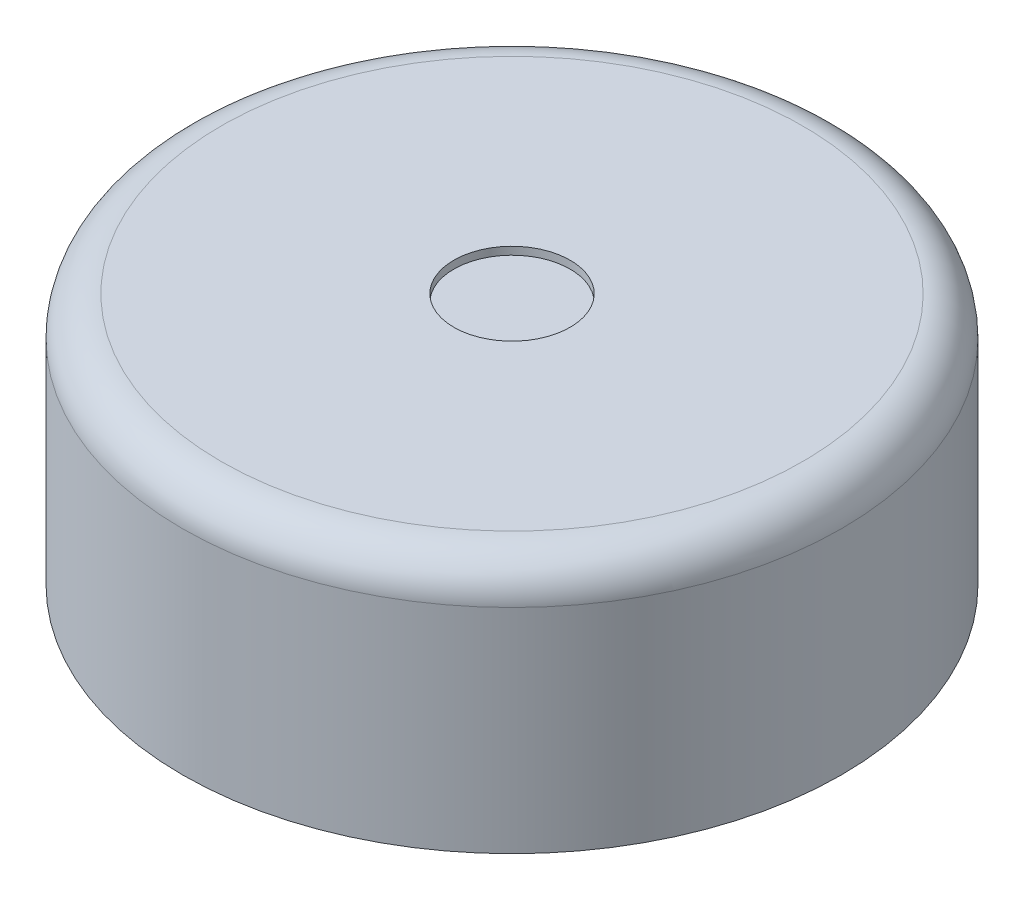
ISO-10303-21;
HEADER;
FILE_DESCRIPTION(('STEP AP214'),'2;1');
FILE_NAME('part.step','',(''),(''),'','','');
FILE_SCHEMA(('AUTOMOTIVE_DESIGN { 1 0 10303 214 1 1 1 1 }'));
ENDSEC;
DATA;
#1=APPLICATION_CONTEXT('core data for automotive mechanical design processes');
#2=APPLICATION_PROTOCOL_DEFINITION('international standard','automotive_design',2000,#1);
#3=PRODUCT_CONTEXT('',#1,'mechanical');
#4=PRODUCT('Part','Part','',(#3));
#5=PRODUCT_RELATED_PRODUCT_CATEGORY('part','',(#4));
#6=PRODUCT_DEFINITION_FORMATION('','',#4);
#7=PRODUCT_DEFINITION_CONTEXT('part definition',#1,'design');
#8=PRODUCT_DEFINITION('design','',#6,#7);
#9=PRODUCT_DEFINITION_SHAPE('','',#8);
#10=(LENGTH_UNIT() NAMED_UNIT(*) SI_UNIT(.MILLI.,.METRE.));
#11=(NAMED_UNIT(*) PLANE_ANGLE_UNIT() SI_UNIT($,.RADIAN.));
#12=(NAMED_UNIT(*) SI_UNIT($,.STERADIAN.) SOLID_ANGLE_UNIT());
#13=UNCERTAINTY_MEASURE_WITH_UNIT(LENGTH_MEASURE(1.E-05),#10,'distance_accuracy_value','');
#14=(GEOMETRIC_REPRESENTATION_CONTEXT(3) GLOBAL_UNCERTAINTY_ASSIGNED_CONTEXT((#13)) GLOBAL_UNIT_ASSIGNED_CONTEXT((#10,
#11,#12)) REPRESENTATION_CONTEXT('',''));
#15=CARTESIAN_POINT('',(0.,0.,0.));
#16=DIRECTION('',(0.,0.,1.));
#17=DIRECTION('',(1.,0.,0.));
#18=AXIS2_PLACEMENT_3D('',#15,#16,#17);
#19=CARTESIAN_POINT('',(0.,0.,0.));
#20=DIRECTION('',(0.,1.,0.));
#21=DIRECTION('',(0.,0.,1.));
#22=AXIS2_PLACEMENT_3D('',#19,#20,#21);
#23=PLANE('',#22);
#24=CARTESIAN_POINT('',(5.,0.,-5.));
#25=DIRECTION('',(0.,1.,0.));
#26=DIRECTION('',(0.,0.,1.));
#27=AXIS2_PLACEMENT_3D('',#24,#25,#26);
#28=CIRCLE('',#27,0.500000000000001);
#29=CARTESIAN_POINT('',(5.,0.,-4.5));
#30=VERTEX_POINT('',#29);
#31=EDGE_CURVE('E71',#30,#30,#28,.F.);
#32=ORIENTED_EDGE('',*,*,#31,.F.);
#33=EDGE_LOOP('',(#32));
#34=FACE_BOUND('',#33,.T.);
#35=CARTESIAN_POINT('',(-5.,0.,5.));
#36=DIRECTION('',(0.,1.,0.));
#37=DIRECTION('',(0.,0.,1.));
#38=AXIS2_PLACEMENT_3D('',#35,#36,#37);
#39=CIRCLE('',#38,0.5);
#40=CARTESIAN_POINT('',(-5.,0.,5.5));
#41=VERTEX_POINT('',#40);
#42=EDGE_CURVE('E74',#41,#41,#39,.F.);
#43=ORIENTED_EDGE('',*,*,#42,.F.);
#44=EDGE_LOOP('',(#43));
#45=FACE_BOUND('',#44,.T.);
#46=CARTESIAN_POINT('',(0.,0.,0.));
#47=DIRECTION('',(0.,1.,0.));
#48=DIRECTION('',(0.,0.,1.));
#49=AXIS2_PLACEMENT_3D('',#46,#47,#48);
#50=CIRCLE('',#49,8.5);
#51=CARTESIAN_POINT('',(0.,0.,8.5));
#52=VERTEX_POINT('',#51);
#53=EDGE_CURVE('E77',#52,#52,#50,.T.);
#54=ORIENTED_EDGE('',*,*,#53,.F.);
#55=EDGE_LOOP('',(#54));
#56=FACE_BOUND('',#55,.T.);
#57=ADVANCED_FACE('F39',(#34,#45,#56),#23,.F.);
#58=CARTESIAN_POINT('',(0.,7.8,0.));
#59=DIRECTION('',(0.,-1.,0.));
#60=DIRECTION('',(0.,0.,-1.));
#61=AXIS2_PLACEMENT_3D('',#58,#59,#60);
#62=CYLINDRICAL_SURFACE('',#61,8.5);
#63=CARTESIAN_POINT('',(0.,5.5,0.));
#64=DIRECTION('',(0.,1.,0.));
#65=DIRECTION('',(0.,0.,1.));
#66=AXIS2_PLACEMENT_3D('',#63,#64,#65);
#67=CIRCLE('',#66,8.5);
#68=CARTESIAN_POINT('',(0.,5.5,8.5));
#69=VERTEX_POINT('',#68);
#70=EDGE_CURVE('E11',#69,#69,#67,.F.);
#71=ORIENTED_EDGE('',*,*,#70,.T.);
#72=EDGE_LOOP('',(#71));
#73=FACE_BOUND('',#72,.T.);
#74=ORIENTED_EDGE('',*,*,#53,.T.);
#75=EDGE_LOOP('',(#74));
#76=FACE_BOUND('',#75,.T.);
#77=ADVANCED_FACE('F105',(#73,#76),#62,.T.);
#78=CARTESIAN_POINT('',(-5.,-2.,5.));
#79=DIRECTION('',(0.,1.,0.));
#80=DIRECTION('',(0.,0.,1.));
#81=AXIS2_PLACEMENT_3D('',#78,#79,#80);
#82=CYLINDRICAL_SURFACE('',#81,0.5);
#83=CARTESIAN_POINT('',(-5.,-1.40098048640719,5.));
#84=DIRECTION('',(0.,-1.,0.));
#85=DIRECTION('',(0.,0.,-1.));
#86=AXIS2_PLACEMENT_3D('',#83,#84,#85);
#87=CIRCLE('',#86,0.5);
#88=CARTESIAN_POINT('',(-5.,-1.40098048640719,4.5));
#89=VERTEX_POINT('',#88);
#90=EDGE_CURVE('E62',#89,#89,#87,.F.);
#91=ORIENTED_EDGE('',*,*,#90,.T.);
#92=EDGE_LOOP('',(#91));
#93=FACE_BOUND('',#92,.T.);
#94=ORIENTED_EDGE('',*,*,#42,.T.);
#95=EDGE_LOOP('',(#94));
#96=FACE_BOUND('',#95,.T.);
#97=ADVANCED_FACE('F110',(#93,#96),#82,.T.);
#98=CARTESIAN_POINT('',(-5.,-2.,5.));
#99=DIRECTION('',(0.,-1.,0.));
#100=DIRECTION('',(0.,0.,-1.));
#101=AXIS2_PLACEMENT_3D('',#98,#99,#100);
#102=PLANE('',#101);
#103=CARTESIAN_POINT('',(-5.,-2.,5.));
#104=DIRECTION('',(0.,-1.,0.));
#105=DIRECTION('',(0.,0.,-1.));
#106=AXIS2_PLACEMENT_3D('',#103,#104,#105);
#107=CIRCLE('',#106,0.399999999999995);
#108=CARTESIAN_POINT('',(-5.,-2.,4.6));
#109=VERTEX_POINT('',#108);
#110=EDGE_CURVE('E68',#109,#109,#107,.T.);
#111=ORIENTED_EDGE('',*,*,#110,.T.);
#112=EDGE_LOOP('',(#111));
#113=FACE_BOUND('',#112,.T.);
#114=ADVANCED_FACE('F138',(#113),#102,.T.);
#115=CARTESIAN_POINT('',(5.,-2.,-5.));
#116=DIRECTION('',(0.,1.,0.));
#117=DIRECTION('',(0.,0.,1.));
#118=AXIS2_PLACEMENT_3D('',#115,#116,#117);
#119=CYLINDRICAL_SURFACE('',#118,0.500000000000001);
#120=CARTESIAN_POINT('',(5.,-1.40098048640718,-5.));
#121=DIRECTION('',(0.,-1.,0.));
#122=DIRECTION('',(0.,0.,-1.));
#123=AXIS2_PLACEMENT_3D('',#120,#121,#122);
#124=CIRCLE('',#123,0.500000000000001);
#125=CARTESIAN_POINT('',(5.,-1.40098048640718,-5.5));
#126=VERTEX_POINT('',#125);
#127=EDGE_CURVE('E54',#126,#126,#124,.F.);
#128=ORIENTED_EDGE('',*,*,#127,.T.);
#129=EDGE_LOOP('',(#128));
#130=FACE_BOUND('',#129,.T.);
#131=ORIENTED_EDGE('',*,*,#31,.T.);
#132=EDGE_LOOP('',(#131));
#133=FACE_BOUND('',#132,.T.);
#134=ADVANCED_FACE('F135',(#130,#133),#119,.T.);
#135=CARTESIAN_POINT('',(5.,-2.,-5.));
#136=DIRECTION('',(0.,-1.,0.));
#137=DIRECTION('',(0.,0.,-1.));
#138=AXIS2_PLACEMENT_3D('',#135,#136,#137);
#139=PLANE('',#138);
#140=CARTESIAN_POINT('',(5.,-2.,-5.));
#141=DIRECTION('',(0.,-1.,0.));
#142=DIRECTION('',(0.,0.,-1.));
#143=AXIS2_PLACEMENT_3D('',#140,#141,#142);
#144=CIRCLE('',#143,0.399999999999996);
#145=CARTESIAN_POINT('',(5.,-2.,-5.4));
#146=VERTEX_POINT('',#145);
#147=EDGE_CURVE('E65',#146,#146,#144,.T.);
#148=ORIENTED_EDGE('',*,*,#147,.T.);
#149=EDGE_LOOP('',(#148));
#150=FACE_BOUND('',#149,.T.);
#151=ADVANCED_FACE('F119',(#150),#139,.T.);
#152=CARTESIAN_POINT('',(-5.,-2.,5.));
#153=DIRECTION('',(0.,1.,0.));
#154=DIRECTION('',(0.,0.,1.));
#155=AXIS2_PLACEMENT_3D('',#152,#153,#154);
#156=CONICAL_SURFACE('',#155,0.399999999999995,0.197395559849878);
#157=CARTESIAN_POINT('',(-5.,-1.59709662154537,5.));
#158=DIRECTION('',(0.,1.,0.));
#159=DIRECTION('',(0.,0.,1.));
#160=AXIS2_PLACEMENT_3D('',#157,#158,#159);
#161=CIRCLE('',#160,0.48058067569092);
#162=CARTESIAN_POINT('',(-5.,-1.59709662154537,5.48058067569092));
#163=VERTEX_POINT('',#162);
#164=EDGE_CURVE('E59',#163,#163,#161,.F.);
#165=ORIENTED_EDGE('',*,*,#164,.T.);
#166=EDGE_LOOP('',(#165));
#167=FACE_BOUND('',#166,.T.);
#168=ORIENTED_EDGE('',*,*,#110,.F.);
#169=EDGE_LOOP('',(#168));
#170=FACE_BOUND('',#169,.T.);
#171=ADVANCED_FACE('F115',(#167,#170),#156,.T.);
#172=CARTESIAN_POINT('',(5.,-2.,-5.));
#173=DIRECTION('',(0.,1.,0.));
#174=DIRECTION('',(0.,0.,1.));
#175=AXIS2_PLACEMENT_3D('',#172,#173,#174);
#176=CONICAL_SURFACE('',#175,0.399999999999996,0.197395559849876);
#177=CARTESIAN_POINT('',(5.,-1.59709662154536,-5.));
#178=DIRECTION('',(0.,1.,0.));
#179=DIRECTION('',(0.,0.,1.));
#180=AXIS2_PLACEMENT_3D('',#177,#178,#179);
#181=CIRCLE('',#180,0.480580675690922);
#182=CARTESIAN_POINT('',(5.,-1.59709662154536,-4.51941932430908));
#183=VERTEX_POINT('',#182);
#184=EDGE_CURVE('E50',#183,#183,#181,.F.);
#185=ORIENTED_EDGE('',*,*,#184,.T.);
#186=EDGE_LOOP('',(#185));
#187=FACE_BOUND('',#186,.T.);
#188=ORIENTED_EDGE('',*,*,#147,.F.);
#189=EDGE_LOOP('',(#188));
#190=FACE_BOUND('',#189,.T.);
#191=ADVANCED_FACE('F118',(#187,#190),#176,.T.);
#192=CARTESIAN_POINT('',(-5.,-1.40098048640719,5.));
#193=DIRECTION('',(0.,-1.,0.));
#194=DIRECTION('',(0.,0.,-1.));
#195=AXIS2_PLACEMENT_3D('',#192,#193,#194);
#196=DEGENERATE_TOROIDAL_SURFACE('',#195,0.5,1.,.F.);
#197=ORIENTED_EDGE('',*,*,#164,.F.);
#198=EDGE_LOOP('',(#197));
#199=FACE_BOUND('',#198,.T.);
#200=ORIENTED_EDGE('',*,*,#90,.F.);
#201=EDGE_LOOP('',(#200));
#202=FACE_BOUND('',#201,.T.);
#203=ADVANCED_FACE('F123',(#199,#202),#196,.F.);
#204=CARTESIAN_POINT('',(5.,-1.40098048640718,-5.));
#205=DIRECTION('',(0.,-1.,0.));
#206=DIRECTION('',(0.,0.,-1.));
#207=AXIS2_PLACEMENT_3D('',#204,#205,#206);
#208=DEGENERATE_TOROIDAL_SURFACE('',#207,0.499999999999999,1.,.F.);
#209=ORIENTED_EDGE('',*,*,#184,.F.);
#210=EDGE_LOOP('',(#209));
#211=FACE_BOUND('',#210,.T.);
#212=ORIENTED_EDGE('',*,*,#127,.F.);
#213=EDGE_LOOP('',(#212));
#214=FACE_BOUND('',#213,.T.);
#215=ADVANCED_FACE('F99',(#211,#214),#208,.F.);
#216=CARTESIAN_POINT('',(0.,6.3,0.));
#217=DIRECTION('',(0.,1.,0.));
#218=DIRECTION('',(0.,0.,1.));
#219=AXIS2_PLACEMENT_3D('',#216,#217,#218);
#220=PLANE('',#219);
#221=CARTESIAN_POINT('',(0.,6.3,0.));
#222=DIRECTION('',(0.,1.,0.));
#223=DIRECTION('',(0.,0.,1.));
#224=AXIS2_PLACEMENT_3D('',#221,#222,#223);
#225=CIRCLE('',#224,1.5);
#226=CARTESIAN_POINT('',(0.,6.3,1.5));
#227=VERTEX_POINT('',#226);
#228=EDGE_CURVE('E80',#227,#227,#225,.T.);
#229=ORIENTED_EDGE('',*,*,#228,.T.);
#230=EDGE_LOOP('',(#229));
#231=FACE_BOUND('',#230,.T.);
#232=ADVANCED_FACE('F91',(#231),#220,.T.);
#233=CARTESIAN_POINT('',(0.,6.3,0.));
#234=DIRECTION('',(0.,1.,0.));
#235=DIRECTION('',(0.,0.,1.));
#236=AXIS2_PLACEMENT_3D('',#233,#234,#235);
#237=CYLINDRICAL_SURFACE('',#236,1.5);
#238=ORIENTED_EDGE('',*,*,#228,.F.);
#239=EDGE_LOOP('',(#238));
#240=FACE_BOUND('',#239,.T.);
#241=CARTESIAN_POINT('',(0.,6.5,0.));
#242=DIRECTION('',(0.,1.,0.));
#243=DIRECTION('',(0.,0.,1.));
#244=AXIS2_PLACEMENT_3D('',#241,#242,#243);
#245=CIRCLE('',#244,1.5);
#246=CARTESIAN_POINT('',(0.,6.5,1.5));
#247=VERTEX_POINT('',#246);
#248=EDGE_CURVE('E83',#247,#247,#245,.F.);
#249=ORIENTED_EDGE('',*,*,#248,.F.);
#250=EDGE_LOOP('',(#249));
#251=FACE_BOUND('',#250,.T.);
#252=ADVANCED_FACE('F89',(#240,#251),#237,.F.);
#253=CARTESIAN_POINT('',(0.,6.5,0.));
#254=DIRECTION('',(0.,1.,0.));
#255=DIRECTION('',(0.,0.,1.));
#256=AXIS2_PLACEMENT_3D('',#253,#254,#255);
#257=PLANE('',#256);
#258=CARTESIAN_POINT('',(0.,6.5,0.));
#259=DIRECTION('',(0.,1.,0.));
#260=DIRECTION('',(0.,0.,1.));
#261=AXIS2_PLACEMENT_3D('',#258,#259,#260);
#262=CIRCLE('',#261,7.5);
#263=CARTESIAN_POINT('',(0.,6.5,7.5));
#264=VERTEX_POINT('',#263);
#265=EDGE_CURVE('E46',#264,#264,#262,.T.);
#266=ORIENTED_EDGE('',*,*,#265,.T.);
#267=EDGE_LOOP('',(#266));
#268=FACE_BOUND('',#267,.T.);
#269=ORIENTED_EDGE('',*,*,#248,.T.);
#270=EDGE_LOOP('',(#269));
#271=FACE_BOUND('',#270,.T.);
#272=ADVANCED_FACE('F87',(#268,#271),#257,.T.);
#273=CARTESIAN_POINT('',(0.,5.5,0.));
#274=DIRECTION('',(0.,1.,0.));
#275=DIRECTION('',(0.,0.,1.));
#276=AXIS2_PLACEMENT_3D('',#273,#274,#275);
#277=TOROIDAL_SURFACE('',#276,7.5,1.);
#278=ORIENTED_EDGE('',*,*,#70,.F.);
#279=EDGE_LOOP('',(#278));
#280=FACE_BOUND('',#279,.T.);
#281=ORIENTED_EDGE('',*,*,#265,.F.);
#282=EDGE_LOOP('',(#281));
#283=FACE_BOUND('',#282,.T.);
#284=ADVANCED_FACE('F41',(#280,#283),#277,.T.);
#285=CLOSED_SHELL('',(#57,#77,#97,#114,#134,#151,#171,#191,#203,#215,#232,#252,#272,#284));
#286=MANIFOLD_SOLID_BREP('B2',#285);
#287=ADVANCED_BREP_SHAPE_REPRESENTATION('',(#18,#286),#14);
#288=SHAPE_DEFINITION_REPRESENTATION(#9,#287);
ENDSEC;
END-ISO-10303-21;
